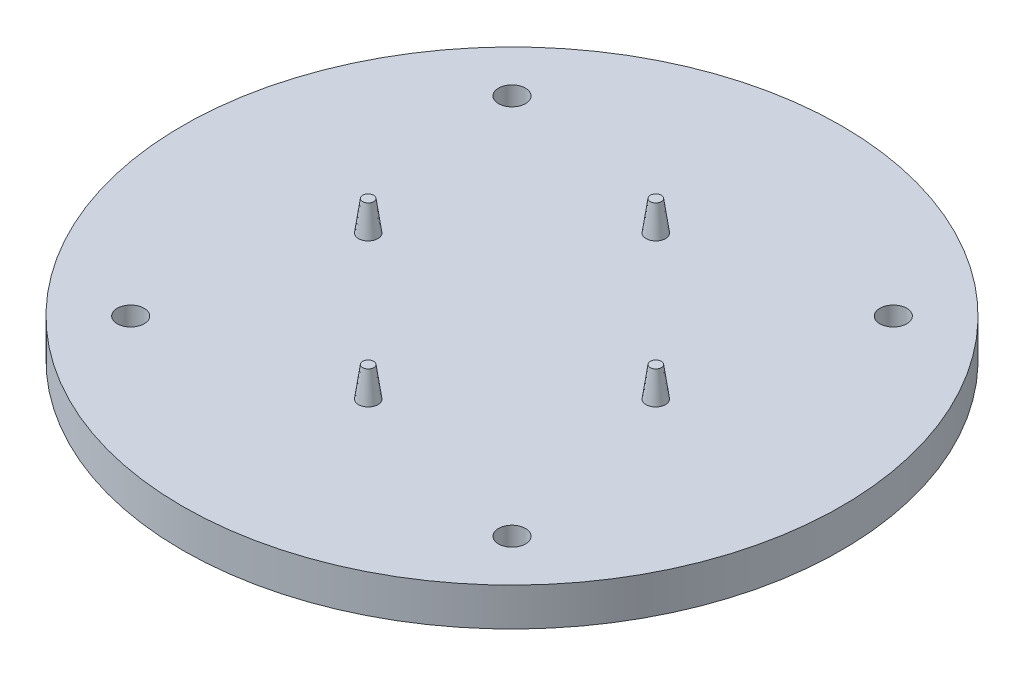
ISO-10303-21;
HEADER;
FILE_DESCRIPTION(('STEP AP214'),'2;1');
FILE_NAME('part.step','',(''),(''),'','','');
FILE_SCHEMA(('AUTOMOTIVE_DESIGN { 1 0 10303 214 1 1 1 1 }'));
ENDSEC;
DATA;
#1=APPLICATION_CONTEXT('core data for automotive mechanical design processes');
#2=APPLICATION_PROTOCOL_DEFINITION('international standard','automotive_design',2000,#1);
#3=PRODUCT_CONTEXT('',#1,'mechanical');
#4=PRODUCT('Part','Part','',(#3));
#5=PRODUCT_RELATED_PRODUCT_CATEGORY('part','',(#4));
#6=PRODUCT_DEFINITION_FORMATION('','',#4);
#7=PRODUCT_DEFINITION_CONTEXT('part definition',#1,'design');
#8=PRODUCT_DEFINITION('design','',#6,#7);
#9=PRODUCT_DEFINITION_SHAPE('','',#8);
#10=(LENGTH_UNIT() NAMED_UNIT(*) SI_UNIT(.MILLI.,.METRE.));
#11=(NAMED_UNIT(*) PLANE_ANGLE_UNIT() SI_UNIT($,.RADIAN.));
#12=(NAMED_UNIT(*) SI_UNIT($,.STERADIAN.) SOLID_ANGLE_UNIT());
#13=UNCERTAINTY_MEASURE_WITH_UNIT(LENGTH_MEASURE(1.E-05),#10,'distance_accuracy_value','');
#14=(GEOMETRIC_REPRESENTATION_CONTEXT(3) GLOBAL_UNCERTAINTY_ASSIGNED_CONTEXT((#13)) GLOBAL_UNIT_ASSIGNED_CONTEXT((#10,
#11,#12)) REPRESENTATION_CONTEXT('',''));
#15=CARTESIAN_POINT('',(0.,0.,0.));
#16=DIRECTION('',(0.,0.,1.));
#17=DIRECTION('',(1.,0.,0.));
#18=AXIS2_PLACEMENT_3D('',#15,#16,#17);
#19=CARTESIAN_POINT('',(0.,6.35,0.));
#20=DIRECTION('',(0.,-1.,0.));
#21=DIRECTION('',(0.,0.,-1.));
#22=AXIS2_PLACEMENT_3D('',#19,#20,#21);
#23=CYLINDRICAL_SURFACE('',#22,55.);
#24=CARTESIAN_POINT('',(0.,6.35,0.));
#25=DIRECTION('',(0.,1.,0.));
#26=DIRECTION('',(0.,0.,1.));
#27=AXIS2_PLACEMENT_3D('',#24,#25,#26);
#28=CIRCLE('',#27,55.);
#29=CARTESIAN_POINT('',(0.,6.35,55.));
#30=VERTEX_POINT('',#29);
#31=EDGE_CURVE('E10',#30,#30,#28,.T.);
#32=ORIENTED_EDGE('',*,*,#31,.F.);
#33=EDGE_LOOP('',(#32));
#34=FACE_BOUND('',#33,.T.);
#35=CARTESIAN_POINT('',(0.,0.,0.));
#36=DIRECTION('',(0.,1.,0.));
#37=DIRECTION('',(0.,0.,1.));
#38=AXIS2_PLACEMENT_3D('',#35,#36,#37);
#39=CIRCLE('',#38,55.);
#40=CARTESIAN_POINT('',(0.,0.,55.));
#41=VERTEX_POINT('',#40);
#42=EDGE_CURVE('E37',#41,#41,#39,.T.);
#43=ORIENTED_EDGE('',*,*,#42,.T.);
#44=EDGE_LOOP('',(#43));
#45=FACE_BOUND('',#44,.T.);
#46=ADVANCED_FACE('F34',(#34,#45),#23,.T.);
#47=CARTESIAN_POINT('',(0.,6.35,0.));
#48=DIRECTION('',(0.,1.,0.));
#49=DIRECTION('',(0.,0.,1.));
#50=AXIS2_PLACEMENT_3D('',#47,#48,#49);
#51=PLANE('',#50);
#52=CARTESIAN_POINT('',(-31.8198051533948,6.35,-31.8198051533945));
#53=DIRECTION('',(0.,1.,0.));
#54=DIRECTION('',(0.,0.,1.));
#55=AXIS2_PLACEMENT_3D('',#52,#53,#54);
#56=CIRCLE('',#55,2.25);
#57=CARTESIAN_POINT('',(-31.8198051533948,6.35,-29.5698051533945));
#58=VERTEX_POINT('',#57);
#59=EDGE_CURVE('E90',#58,#58,#56,.T.);
#60=ORIENTED_EDGE('',*,*,#59,.F.);
#61=EDGE_LOOP('',(#60));
#62=FACE_BOUND('',#61,.T.);
#63=CARTESIAN_POINT('',(31.8198051533944,6.35,-31.8198051533948));
#64=DIRECTION('',(0.,1.,0.));
#65=DIRECTION('',(0.,0.,1.));
#66=AXIS2_PLACEMENT_3D('',#63,#64,#65);
#67=CIRCLE('',#66,2.25);
#68=CARTESIAN_POINT('',(31.8198051533944,6.35,-29.5698051533948));
#69=VERTEX_POINT('',#68);
#70=EDGE_CURVE('E84',#69,#69,#67,.T.);
#71=ORIENTED_EDGE('',*,*,#70,.F.);
#72=EDGE_LOOP('',(#71));
#73=FACE_BOUND('',#72,.T.);
#74=CARTESIAN_POINT('',(31.8198051533948,6.35,31.8198051533945));
#75=DIRECTION('',(0.,1.,0.));
#76=DIRECTION('',(0.,0.,1.));
#77=AXIS2_PLACEMENT_3D('',#74,#75,#76);
#78=CIRCLE('',#77,2.25);
#79=CARTESIAN_POINT('',(31.8198051533948,6.35,34.0698051533945));
#80=VERTEX_POINT('',#79);
#81=EDGE_CURVE('E78',#80,#80,#78,.T.);
#82=ORIENTED_EDGE('',*,*,#81,.F.);
#83=EDGE_LOOP('',(#82));
#84=FACE_BOUND('',#83,.T.);
#85=CARTESIAN_POINT('',(-31.8198051533945,6.35,31.8198051533948));
#86=DIRECTION('',(0.,1.,0.));
#87=DIRECTION('',(0.,0.,1.));
#88=AXIS2_PLACEMENT_3D('',#85,#86,#87);
#89=CIRCLE('',#88,2.25);
#90=CARTESIAN_POINT('',(-31.8198051533945,6.35,34.0698051533948));
#91=VERTEX_POINT('',#90);
#92=EDGE_CURVE('E72',#91,#91,#89,.T.);
#93=ORIENTED_EDGE('',*,*,#92,.F.);
#94=EDGE_LOOP('',(#93));
#95=FACE_BOUND('',#94,.T.);
#96=CARTESIAN_POINT('',(24.,6.35,2.51386656396706E-13));
#97=DIRECTION('',(0.,1.,0.));
#98=DIRECTION('',(0.,0.,1.));
#99=AXIS2_PLACEMENT_3D('',#96,#97,#98);
#100=CIRCLE('',#99,1.625);
#101=CARTESIAN_POINT('',(24.,6.35,1.62500000000025));
#102=VERTEX_POINT('',#101);
#103=EDGE_CURVE('E66',#102,#102,#100,.T.);
#104=ORIENTED_EDGE('',*,*,#103,.F.);
#105=EDGE_LOOP('',(#104));
#106=FACE_BOUND('',#105,.T.);
#107=CARTESIAN_POINT('',(1.6759110426447E-13,6.35,-24.));
#108=DIRECTION('',(0.,1.,0.));
#109=DIRECTION('',(0.,0.,1.));
#110=AXIS2_PLACEMENT_3D('',#107,#108,#109);
#111=CIRCLE('',#110,1.625);
#112=CARTESIAN_POINT('',(1.6759110426447E-13,6.35,-22.375));
#113=VERTEX_POINT('',#112);
#114=EDGE_CURVE('E60',#113,#113,#111,.T.);
#115=ORIENTED_EDGE('',*,*,#114,.F.);
#116=EDGE_LOOP('',(#115));
#117=FACE_BOUND('',#116,.T.);
#118=CARTESIAN_POINT('',(-24.,6.35,0.));
#119=DIRECTION('',(0.,1.,0.));
#120=DIRECTION('',(0.,0.,1.));
#121=AXIS2_PLACEMENT_3D('',#118,#119,#120);
#122=CIRCLE('',#121,1.625);
#123=CARTESIAN_POINT('',(-24.,6.35,1.62499999999992));
#124=VERTEX_POINT('',#123);
#125=EDGE_CURVE('E54',#124,#124,#122,.T.);
#126=ORIENTED_EDGE('',*,*,#125,.F.);
#127=EDGE_LOOP('',(#126));
#128=FACE_BOUND('',#127,.T.);
#129=CARTESIAN_POINT('',(0.,6.35,24.));
#130=DIRECTION('',(0.,1.,0.));
#131=DIRECTION('',(0.,0.,1.));
#132=AXIS2_PLACEMENT_3D('',#129,#130,#131);
#133=CIRCLE('',#132,1.625);
#134=CARTESIAN_POINT('',(0.,6.35,25.625));
#135=VERTEX_POINT('',#134);
#136=EDGE_CURVE('E48',#135,#135,#133,.T.);
#137=ORIENTED_EDGE('',*,*,#136,.F.);
#138=EDGE_LOOP('',(#137));
#139=FACE_BOUND('',#138,.T.);
#140=ORIENTED_EDGE('',*,*,#31,.T.);
#141=EDGE_LOOP('',(#140));
#142=FACE_BOUND('',#141,.T.);
#143=ADVANCED_FACE('F96',(#62,#73,#84,#95,#106,#117,#128,#139,#142),#51,.T.);
#144=CARTESIAN_POINT('',(0.,0.,0.));
#145=DIRECTION('',(0.,1.,0.));
#146=DIRECTION('',(0.,0.,1.));
#147=AXIS2_PLACEMENT_3D('',#144,#145,#146);
#148=PLANE('',#147);
#149=CARTESIAN_POINT('',(-31.8198051533948,0.,-31.8198051533945));
#150=DIRECTION('',(0.,1.,0.));
#151=DIRECTION('',(0.,0.,1.));
#152=AXIS2_PLACEMENT_3D('',#149,#150,#151);
#153=CIRCLE('',#152,2.25);
#154=CARTESIAN_POINT('',(-31.8198051533948,0.,-29.5698051533945));
#155=VERTEX_POINT('',#154);
#156=EDGE_CURVE('E87',#155,#155,#153,.T.);
#157=ORIENTED_EDGE('',*,*,#156,.T.);
#158=EDGE_LOOP('',(#157));
#159=FACE_BOUND('',#158,.T.);
#160=CARTESIAN_POINT('',(31.8198051533944,0.,-31.8198051533948));
#161=DIRECTION('',(0.,1.,0.));
#162=DIRECTION('',(0.,0.,1.));
#163=AXIS2_PLACEMENT_3D('',#160,#161,#162);
#164=CIRCLE('',#163,2.25);
#165=CARTESIAN_POINT('',(31.8198051533944,0.,-29.5698051533948));
#166=VERTEX_POINT('',#165);
#167=EDGE_CURVE('E81',#166,#166,#164,.T.);
#168=ORIENTED_EDGE('',*,*,#167,.T.);
#169=EDGE_LOOP('',(#168));
#170=FACE_BOUND('',#169,.T.);
#171=CARTESIAN_POINT('',(31.8198051533948,0.,31.8198051533945));
#172=DIRECTION('',(0.,1.,0.));
#173=DIRECTION('',(0.,0.,1.));
#174=AXIS2_PLACEMENT_3D('',#171,#172,#173);
#175=CIRCLE('',#174,2.25);
#176=CARTESIAN_POINT('',(31.8198051533948,0.,34.0698051533945));
#177=VERTEX_POINT('',#176);
#178=EDGE_CURVE('E75',#177,#177,#175,.T.);
#179=ORIENTED_EDGE('',*,*,#178,.T.);
#180=EDGE_LOOP('',(#179));
#181=FACE_BOUND('',#180,.T.);
#182=CARTESIAN_POINT('',(-31.8198051533945,0.,31.8198051533948));
#183=DIRECTION('',(0.,1.,0.));
#184=DIRECTION('',(0.,0.,1.));
#185=AXIS2_PLACEMENT_3D('',#182,#183,#184);
#186=CIRCLE('',#185,2.25);
#187=CARTESIAN_POINT('',(-31.8198051533945,0.,34.0698051533948));
#188=VERTEX_POINT('',#187);
#189=EDGE_CURVE('E69',#188,#188,#186,.T.);
#190=ORIENTED_EDGE('',*,*,#189,.T.);
#191=EDGE_LOOP('',(#190));
#192=FACE_BOUND('',#191,.T.);
#193=ORIENTED_EDGE('',*,*,#42,.F.);
#194=EDGE_LOOP('',(#193));
#195=FACE_BOUND('',#194,.T.);
#196=ADVANCED_FACE('F99',(#159,#170,#181,#192,#195),#148,.F.);
#197=CARTESIAN_POINT('',(0.,6.35,24.));
#198=DIRECTION('',(0.,-1.,0.));
#199=DIRECTION('',(0.,0.,1.));
#200=AXIS2_PLACEMENT_3D('',#197,#198,#199);
#201=CONICAL_SURFACE('',#200,1.625,0.139626340159546);
#202=CARTESIAN_POINT('',(0.,11.35,24.));
#203=DIRECTION('',(0.,1.,0.));
#204=DIRECTION('',(0.,0.,1.));
#205=AXIS2_PLACEMENT_3D('',#202,#203,#204);
#206=CIRCLE('',#205,0.922295826488043);
#207=CARTESIAN_POINT('',(0.,11.35,24.922295826488));
#208=VERTEX_POINT('',#207);
#209=EDGE_CURVE('E44',#208,#208,#206,.T.);
#210=ORIENTED_EDGE('',*,*,#209,.F.);
#211=EDGE_LOOP('',(#210));
#212=FACE_BOUND('',#211,.T.);
#213=ORIENTED_EDGE('',*,*,#136,.T.);
#214=EDGE_LOOP('',(#213));
#215=FACE_BOUND('',#214,.T.);
#216=ADVANCED_FACE('F115',(#212,#215),#201,.T.);
#217=CARTESIAN_POINT('',(0.,11.35,24.));
#218=DIRECTION('',(0.,1.,0.));
#219=DIRECTION('',(0.,0.,1.));
#220=AXIS2_PLACEMENT_3D('',#217,#218,#219);
#221=PLANE('',#220);
#222=ORIENTED_EDGE('',*,*,#209,.T.);
#223=EDGE_LOOP('',(#222));
#224=FACE_BOUND('',#223,.T.);
#225=ADVANCED_FACE('F117',(#224),#221,.T.);
#226=CARTESIAN_POINT('',(-24.,6.35,0.));
#227=DIRECTION('',(0.,-1.,0.));
#228=DIRECTION('',(0.,0.,1.));
#229=AXIS2_PLACEMENT_3D('',#226,#227,#228);
#230=CONICAL_SURFACE('',#229,1.625,0.139626340159546);
#231=CARTESIAN_POINT('',(-24.,11.35,0.));
#232=DIRECTION('',(0.,1.,0.));
#233=DIRECTION('',(0.,0.,1.));
#234=AXIS2_PLACEMENT_3D('',#231,#232,#233);
#235=CIRCLE('',#234,0.922295826488042);
#236=CARTESIAN_POINT('',(-24.,11.35,0.922295826487958));
#237=VERTEX_POINT('',#236);
#238=EDGE_CURVE('E51',#237,#237,#235,.T.);
#239=ORIENTED_EDGE('',*,*,#238,.F.);
#240=EDGE_LOOP('',(#239));
#241=FACE_BOUND('',#240,.T.);
#242=ORIENTED_EDGE('',*,*,#125,.T.);
#243=EDGE_LOOP('',(#242));
#244=FACE_BOUND('',#243,.T.);
#245=ADVANCED_FACE('F124',(#241,#244),#230,.T.);
#246=CARTESIAN_POINT('',(-24.,11.35,0.));
#247=DIRECTION('',(0.,1.,0.));
#248=DIRECTION('',(0.,0.,1.));
#249=AXIS2_PLACEMENT_3D('',#246,#247,#248);
#250=PLANE('',#249);
#251=ORIENTED_EDGE('',*,*,#238,.T.);
#252=EDGE_LOOP('',(#251));
#253=FACE_BOUND('',#252,.T.);
#254=ADVANCED_FACE('F209',(#253),#250,.T.);
#255=CARTESIAN_POINT('',(1.6759110426447E-13,6.35,-24.));
#256=DIRECTION('',(0.,-1.,0.));
#257=DIRECTION('',(0.,0.,1.));
#258=AXIS2_PLACEMENT_3D('',#255,#256,#257);
#259=CONICAL_SURFACE('',#258,1.625,0.139626340159546);
#260=CARTESIAN_POINT('',(1.6759110426447E-13,11.35,-24.));
#261=DIRECTION('',(0.,1.,0.));
#262=DIRECTION('',(0.,0.,1.));
#263=AXIS2_PLACEMENT_3D('',#260,#261,#262);
#264=CIRCLE('',#263,0.922295826488043);
#265=CARTESIAN_POINT('',(1.6759110426447E-13,11.35,-23.077704173512));
#266=VERTEX_POINT('',#265);
#267=EDGE_CURVE('E57',#266,#266,#264,.T.);
#268=ORIENTED_EDGE('',*,*,#267,.F.);
#269=EDGE_LOOP('',(#268));
#270=FACE_BOUND('',#269,.T.);
#271=ORIENTED_EDGE('',*,*,#114,.T.);
#272=EDGE_LOOP('',(#271));
#273=FACE_BOUND('',#272,.T.);
#274=ADVANCED_FACE('F205',(#270,#273),#259,.T.);
#275=CARTESIAN_POINT('',(1.6759110426447E-13,11.35,-24.));
#276=DIRECTION('',(0.,1.,0.));
#277=DIRECTION('',(0.,0.,1.));
#278=AXIS2_PLACEMENT_3D('',#275,#276,#277);
#279=PLANE('',#278);
#280=ORIENTED_EDGE('',*,*,#267,.T.);
#281=EDGE_LOOP('',(#280));
#282=FACE_BOUND('',#281,.T.);
#283=ADVANCED_FACE('F201',(#282),#279,.T.);
#284=CARTESIAN_POINT('',(24.,6.35,2.51386656396706E-13));
#285=DIRECTION('',(0.,-1.,0.));
#286=DIRECTION('',(0.,0.,1.));
#287=AXIS2_PLACEMENT_3D('',#284,#285,#286);
#288=CONICAL_SURFACE('',#287,1.625,0.139626340159546);
#289=CARTESIAN_POINT('',(24.,11.35,2.51386656396706E-13));
#290=DIRECTION('',(0.,1.,0.));
#291=DIRECTION('',(0.,0.,1.));
#292=AXIS2_PLACEMENT_3D('',#289,#290,#291);
#293=CIRCLE('',#292,0.922295826488043);
#294=CARTESIAN_POINT('',(24.,11.35,0.922295826488294));
#295=VERTEX_POINT('',#294);
#296=EDGE_CURVE('E63',#295,#295,#293,.T.);
#297=ORIENTED_EDGE('',*,*,#296,.F.);
#298=EDGE_LOOP('',(#297));
#299=FACE_BOUND('',#298,.T.);
#300=ORIENTED_EDGE('',*,*,#103,.T.);
#301=EDGE_LOOP('',(#300));
#302=FACE_BOUND('',#301,.T.);
#303=ADVANCED_FACE('F197',(#299,#302),#288,.T.);
#304=CARTESIAN_POINT('',(24.,11.35,2.51386656396706E-13));
#305=DIRECTION('',(0.,1.,0.));
#306=DIRECTION('',(0.,0.,1.));
#307=AXIS2_PLACEMENT_3D('',#304,#305,#306);
#308=PLANE('',#307);
#309=ORIENTED_EDGE('',*,*,#296,.T.);
#310=EDGE_LOOP('',(#309));
#311=FACE_BOUND('',#310,.T.);
#312=ADVANCED_FACE('F159',(#311),#308,.T.);
#313=CARTESIAN_POINT('',(-31.8198051533945,6.35,31.8198051533948));
#314=DIRECTION('',(0.,1.,0.));
#315=DIRECTION('',(0.,0.,1.));
#316=AXIS2_PLACEMENT_3D('',#313,#314,#315);
#317=CYLINDRICAL_SURFACE('',#316,2.25);
#318=ORIENTED_EDGE('',*,*,#189,.F.);
#319=EDGE_LOOP('',(#318));
#320=FACE_BOUND('',#319,.T.);
#321=ORIENTED_EDGE('',*,*,#92,.T.);
#322=EDGE_LOOP('',(#321));
#323=FACE_BOUND('',#322,.T.);
#324=ADVANCED_FACE('F153',(#320,#323),#317,.F.);
#325=CARTESIAN_POINT('',(31.8198051533948,6.35,31.8198051533945));
#326=DIRECTION('',(0.,1.,0.));
#327=DIRECTION('',(0.,0.,1.));
#328=AXIS2_PLACEMENT_3D('',#325,#326,#327);
#329=CYLINDRICAL_SURFACE('',#328,2.25);
#330=ORIENTED_EDGE('',*,*,#178,.F.);
#331=EDGE_LOOP('',(#330));
#332=FACE_BOUND('',#331,.T.);
#333=ORIENTED_EDGE('',*,*,#81,.T.);
#334=EDGE_LOOP('',(#333));
#335=FACE_BOUND('',#334,.T.);
#336=ADVANCED_FACE('F158',(#332,#335),#329,.F.);
#337=CARTESIAN_POINT('',(31.8198051533944,6.35,-31.8198051533948));
#338=DIRECTION('',(0.,1.,0.));
#339=DIRECTION('',(0.,0.,1.));
#340=AXIS2_PLACEMENT_3D('',#337,#338,#339);
#341=CYLINDRICAL_SURFACE('',#340,2.25);
#342=ORIENTED_EDGE('',*,*,#167,.F.);
#343=EDGE_LOOP('',(#342));
#344=FACE_BOUND('',#343,.T.);
#345=ORIENTED_EDGE('',*,*,#70,.T.);
#346=EDGE_LOOP('',(#345));
#347=FACE_BOUND('',#346,.T.);
#348=ADVANCED_FACE('F171',(#344,#347),#341,.F.);
#349=CARTESIAN_POINT('',(-31.8198051533948,6.35,-31.8198051533945));
#350=DIRECTION('',(0.,1.,0.));
#351=DIRECTION('',(0.,0.,1.));
#352=AXIS2_PLACEMENT_3D('',#349,#350,#351);
#353=CYLINDRICAL_SURFACE('',#352,2.25);
#354=ORIENTED_EDGE('',*,*,#156,.F.);
#355=EDGE_LOOP('',(#354));
#356=FACE_BOUND('',#355,.T.);
#357=ORIENTED_EDGE('',*,*,#59,.T.);
#358=EDGE_LOOP('',(#357));
#359=FACE_BOUND('',#358,.T.);
#360=ADVANCED_FACE('F94',(#356,#359),#353,.F.);
#361=CLOSED_SHELL('',(#46,#143,#196,#216,#225,#245,#254,#274,#283,#303,#312,#324,#336,#348,#360));
#362=MANIFOLD_SOLID_BREP('B2',#361);
#363=ADVANCED_BREP_SHAPE_REPRESENTATION('',(#18,#362),#14);
#364=SHAPE_DEFINITION_REPRESENTATION(#9,#363);
ENDSEC;
END-ISO-10303-21;
